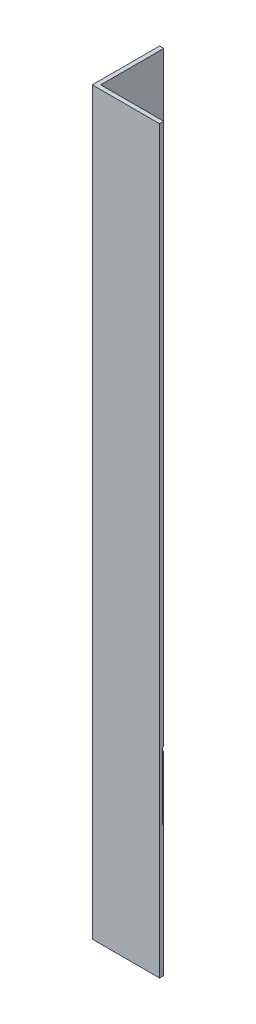
ISO-10303-21;
HEADER;
FILE_DESCRIPTION(('STEP AP214'),'2;1');
FILE_NAME('part.step','',(''),(''),'','','');
FILE_SCHEMA(('AUTOMOTIVE_DESIGN { 1 0 10303 214 1 1 1 1 }'));
ENDSEC;
DATA;
#1=APPLICATION_CONTEXT('core data for automotive mechanical design processes');
#2=APPLICATION_PROTOCOL_DEFINITION('international standard','automotive_design',2000,#1);
#3=PRODUCT_CONTEXT('',#1,'mechanical');
#4=PRODUCT('Part','Part','',(#3));
#5=PRODUCT_RELATED_PRODUCT_CATEGORY('part','',(#4));
#6=PRODUCT_DEFINITION_FORMATION('','',#4);
#7=PRODUCT_DEFINITION_CONTEXT('part definition',#1,'design');
#8=PRODUCT_DEFINITION('design','',#6,#7);
#9=PRODUCT_DEFINITION_SHAPE('','',#8);
#10=(LENGTH_UNIT() NAMED_UNIT(*) SI_UNIT(.MILLI.,.METRE.));
#11=(NAMED_UNIT(*) PLANE_ANGLE_UNIT() SI_UNIT($,.RADIAN.));
#12=(NAMED_UNIT(*) SI_UNIT($,.STERADIAN.) SOLID_ANGLE_UNIT());
#13=UNCERTAINTY_MEASURE_WITH_UNIT(LENGTH_MEASURE(1.E-05),#10,'distance_accuracy_value','');
#14=(GEOMETRIC_REPRESENTATION_CONTEXT(3) GLOBAL_UNCERTAINTY_ASSIGNED_CONTEXT((#13)) GLOBAL_UNIT_ASSIGNED_CONTEXT((#10,
#11,#12)) REPRESENTATION_CONTEXT('',''));
#15=CARTESIAN_POINT('',(0.,0.,0.));
#16=DIRECTION('',(0.,0.,1.));
#17=DIRECTION('',(1.,0.,0.));
#18=AXIS2_PLACEMENT_3D('',#15,#16,#17);
#19=CARTESIAN_POINT('',(1.5875,279.4,-1.5875));
#20=DIRECTION('',(0.,0.,1.));
#21=DIRECTION('',(1.,0.,0.));
#22=AXIS2_PLACEMENT_3D('',#19,#20,#21);
#23=PLANE('',#22);
#24=DIRECTION('',(0.,-1.,0.));
#25=VECTOR('',#24,1.);
#26=CARTESIAN_POINT('',(25.4,279.4,-1.5875));
#27=LINE('',#26,#25);
#28=CARTESIAN_POINT('',(25.4,279.4,-1.5875));
#29=VERTEX_POINT('',#28);
#30=CARTESIAN_POINT('',(25.4,75.0189,-1.5875));
#31=VERTEX_POINT('',#30);
#32=EDGE_CURVE('E43',#29,#31,#27,.T.);
#33=ORIENTED_EDGE('',*,*,#32,.T.);
#34=DIRECTION('',(-1.,0.,0.));
#35=VECTOR('',#34,1.);
#36=CARTESIAN_POINT('',(1.5875,75.0189,-1.5875));
#37=LINE('',#36,#35);
#38=CARTESIAN_POINT('',(1.5875,75.0189,-1.5875));
#39=VERTEX_POINT('',#38);
#40=EDGE_CURVE('E138',#31,#39,#37,.T.);
#41=ORIENTED_EDGE('',*,*,#40,.T.);
#42=DIRECTION('',(0.,-1.,0.));
#43=VECTOR('',#42,1.);
#44=CARTESIAN_POINT('',(1.5875,279.4,-1.5875));
#45=LINE('',#44,#43);
#46=CARTESIAN_POINT('',(1.5875,279.4,-1.5875));
#47=VERTEX_POINT('',#46);
#48=EDGE_CURVE('E155',#47,#39,#45,.T.);
#49=ORIENTED_EDGE('',*,*,#48,.F.);
#50=DIRECTION('',(-1.,0.,0.));
#51=VECTOR('',#50,1.);
#52=CARTESIAN_POINT('',(1.5875,279.4,-1.5875));
#53=LINE('',#52,#51);
#54=EDGE_CURVE('E109',#29,#47,#53,.T.);
#55=ORIENTED_EDGE('',*,*,#54,.F.);
#56=EDGE_LOOP('',(#33,#41,#49,#55));
#57=FACE_BOUND('',#56,.T.);
#58=ADVANCED_FACE('F35',(#57),#23,.F.);
#59=CARTESIAN_POINT('',(1.5875,279.4,-25.4));
#60=DIRECTION('',(-1.,0.,0.));
#61=DIRECTION('',(0.,0.,1.));
#62=AXIS2_PLACEMENT_3D('',#59,#60,#61);
#63=PLANE('',#62);
#64=ORIENTED_EDGE('',*,*,#48,.T.);
#65=DIRECTION('',(0.,0.,-1.));
#66=VECTOR('',#65,1.);
#67=CARTESIAN_POINT('',(1.5875,75.0189,-25.4));
#68=LINE('',#67,#66);
#69=CARTESIAN_POINT('',(1.5875,75.0189,-25.4));
#70=VERTEX_POINT('',#69);
#71=EDGE_CURVE('E120',#39,#70,#68,.T.);
#72=ORIENTED_EDGE('',*,*,#71,.T.);
#73=DIRECTION('',(0.,-1.,0.));
#74=VECTOR('',#73,1.);
#75=CARTESIAN_POINT('',(1.5875,279.4,-25.4));
#76=LINE('',#75,#74);
#77=CARTESIAN_POINT('',(1.5875,279.4,-25.4));
#78=VERTEX_POINT('',#77);
#79=EDGE_CURVE('E116',#78,#70,#76,.T.);
#80=ORIENTED_EDGE('',*,*,#79,.F.);
#81=DIRECTION('',(0.,0.,-1.));
#82=VECTOR('',#81,1.);
#83=CARTESIAN_POINT('',(1.5875,279.4,-25.4));
#84=LINE('',#83,#82);
#85=EDGE_CURVE('E102',#47,#78,#84,.T.);
#86=ORIENTED_EDGE('',*,*,#85,.F.);
#87=EDGE_LOOP('',(#64,#72,#80,#86));
#88=FACE_BOUND('',#87,.T.);
#89=ADVANCED_FACE('F117',(#88),#63,.F.);
#90=CARTESIAN_POINT('',(0.,279.4,-25.4));
#91=DIRECTION('',(0.,0.,1.));
#92=DIRECTION('',(1.,0.,0.));
#93=AXIS2_PLACEMENT_3D('',#90,#91,#92);
#94=PLANE('',#93);
#95=ORIENTED_EDGE('',*,*,#79,.T.);
#96=DIRECTION('',(-1.,0.,0.));
#97=VECTOR('',#96,1.);
#98=CARTESIAN_POINT('',(25.4,75.0189,-25.4));
#99=LINE('',#98,#97);
#100=CARTESIAN_POINT('',(0.,75.0189,-25.4));
#101=VERTEX_POINT('',#100);
#102=EDGE_CURVE('E195',#70,#101,#99,.T.);
#103=ORIENTED_EDGE('',*,*,#102,.T.);
#104=DIRECTION('',(0.,-1.,0.));
#105=VECTOR('',#104,1.);
#106=CARTESIAN_POINT('',(0.,279.4,-25.4));
#107=LINE('',#106,#105);
#108=CARTESIAN_POINT('',(0.,279.4,-25.4));
#109=VERTEX_POINT('',#108);
#110=EDGE_CURVE('E128',#109,#101,#107,.T.);
#111=ORIENTED_EDGE('',*,*,#110,.F.);
#112=DIRECTION('',(-1.,0.,0.));
#113=VECTOR('',#112,1.);
#114=CARTESIAN_POINT('',(0.,279.4,-25.4));
#115=LINE('',#114,#113);
#116=EDGE_CURVE('E106',#78,#109,#115,.T.);
#117=ORIENTED_EDGE('',*,*,#116,.F.);
#118=EDGE_LOOP('',(#95,#103,#111,#117));
#119=FACE_BOUND('',#118,.T.);
#120=ADVANCED_FACE('F126',(#119),#94,.F.);
#121=CARTESIAN_POINT('',(25.4,279.4,0.));
#122=DIRECTION('',(0.,0.,-1.));
#123=DIRECTION('',(-1.,0.,0.));
#124=AXIS2_PLACEMENT_3D('',#121,#122,#123);
#125=PLANE('',#124);
#126=DIRECTION('',(1.,0.,0.));
#127=VECTOR('',#126,1.);
#128=CARTESIAN_POINT('',(25.4,0.,0.));
#129=LINE('',#128,#127);
#130=CARTESIAN_POINT('',(0.,0.,0.));
#131=VERTEX_POINT('',#130);
#132=CARTESIAN_POINT('',(25.4,0.,0.));
#133=VERTEX_POINT('',#132);
#134=EDGE_CURVE('E134',#131,#133,#129,.T.);
#135=ORIENTED_EDGE('',*,*,#134,.T.);
#136=DIRECTION('',(0.,-1.,0.));
#137=VECTOR('',#136,1.);
#138=CARTESIAN_POINT('',(25.4,279.4,0.));
#139=LINE('',#138,#137);
#140=CARTESIAN_POINT('',(25.4,279.4,0.));
#141=VERTEX_POINT('',#140);
#142=EDGE_CURVE('E11',#141,#133,#139,.T.);
#143=ORIENTED_EDGE('',*,*,#142,.F.);
#144=DIRECTION('',(1.,0.,0.));
#145=VECTOR('',#144,1.);
#146=CARTESIAN_POINT('',(25.4,279.4,0.));
#147=LINE('',#146,#145);
#148=CARTESIAN_POINT('',(0.,279.4,0.));
#149=VERTEX_POINT('',#148);
#150=EDGE_CURVE('E151',#149,#141,#147,.T.);
#151=ORIENTED_EDGE('',*,*,#150,.F.);
#152=DIRECTION('',(0.,-1.,0.));
#153=VECTOR('',#152,1.);
#154=CARTESIAN_POINT('',(0.,279.4,0.));
#155=LINE('',#154,#153);
#156=EDGE_CURVE('E130',#149,#131,#155,.T.);
#157=ORIENTED_EDGE('',*,*,#156,.T.);
#158=EDGE_LOOP('',(#135,#143,#151,#157));
#159=FACE_BOUND('',#158,.T.);
#160=ADVANCED_FACE('F37',(#159),#125,.F.);
#161=CARTESIAN_POINT('',(25.4,279.4,-1.5875));
#162=DIRECTION('',(-1.,0.,0.));
#163=DIRECTION('',(0.,0.,1.));
#164=AXIS2_PLACEMENT_3D('',#161,#162,#163);
#165=PLANE('',#164);
#166=DIRECTION('',(0.,1.,0.));
#167=VECTOR('',#166,1.);
#168=CARTESIAN_POINT('',(25.4,49.6189,-1.084072));
#169=LINE('',#168,#167);
#170=CARTESIAN_POINT('',(25.4,49.6189,-1.084072));
#171=VERTEX_POINT('',#170);
#172=CARTESIAN_POINT('',(25.4,75.0189,-1.084072));
#173=VERTEX_POINT('',#172);
#174=EDGE_CURVE('E208',#171,#173,#169,.T.);
#175=ORIENTED_EDGE('',*,*,#174,.T.);
#176=DIRECTION('',(0.,0.,-1.));
#177=VECTOR('',#176,1.);
#178=CARTESIAN_POINT('',(25.4,75.0189,-25.4));
#179=LINE('',#178,#177);
#180=EDGE_CURVE('E205',#173,#31,#179,.T.);
#181=ORIENTED_EDGE('',*,*,#180,.T.);
#182=ORIENTED_EDGE('',*,*,#32,.F.);
#183=DIRECTION('',(0.,0.,-1.));
#184=VECTOR('',#183,1.);
#185=CARTESIAN_POINT('',(25.4,279.4,-1.5875));
#186=LINE('',#185,#184);
#187=EDGE_CURVE('E93',#141,#29,#186,.T.);
#188=ORIENTED_EDGE('',*,*,#187,.F.);
#189=ORIENTED_EDGE('',*,*,#142,.T.);
#190=DIRECTION('',(0.,0.,-1.));
#191=VECTOR('',#190,1.);
#192=CARTESIAN_POINT('',(25.4,0.,-1.5875));
#193=LINE('',#192,#191);
#194=CARTESIAN_POINT('',(25.4,0.,-1.5875));
#195=VERTEX_POINT('',#194);
#196=EDGE_CURVE('E137',#133,#195,#193,.T.);
#197=ORIENTED_EDGE('',*,*,#196,.T.);
#198=CARTESIAN_POINT('',(25.4,49.6189,-1.5875));
#199=VERTEX_POINT('',#198);
#200=EDGE_CURVE('E156',#199,#195,#27,.T.);
#201=ORIENTED_EDGE('',*,*,#200,.F.);
#202=DIRECTION('',(0.,0.,1.));
#203=VECTOR('',#202,1.);
#204=CARTESIAN_POINT('',(25.4,49.6189,-25.4));
#205=LINE('',#204,#203);
#206=EDGE_CURVE('E213',#199,#171,#205,.T.);
#207=ORIENTED_EDGE('',*,*,#206,.T.);
#208=EDGE_LOOP('',(#175,#181,#182,#188,#189,#197,#201,#207));
#209=FACE_BOUND('',#208,.T.);
#210=ADVANCED_FACE('F173',(#209),#165,.F.);
#211=CARTESIAN_POINT('',(1.5875,49.6189,-1.5875));
#212=VERTEX_POINT('',#211);
#213=CARTESIAN_POINT('',(1.5875,0.,-1.5875));
#214=VERTEX_POINT('',#213);
#215=EDGE_CURVE('E123',#212,#214,#45,.T.);
#216=ORIENTED_EDGE('',*,*,#215,.F.);
#217=DIRECTION('',(1.,0.,0.));
#218=VECTOR('',#217,1.);
#219=CARTESIAN_POINT('',(1.5875,49.6189,-1.5875));
#220=LINE('',#219,#218);
#221=EDGE_CURVE('E170',#212,#199,#220,.T.);
#222=ORIENTED_EDGE('',*,*,#221,.T.);
#223=ORIENTED_EDGE('',*,*,#200,.T.);
#224=DIRECTION('',(-1.,0.,0.));
#225=VECTOR('',#224,1.);
#226=CARTESIAN_POINT('',(1.5875,0.,-1.5875));
#227=LINE('',#226,#225);
#228=EDGE_CURVE('E141',#195,#214,#227,.T.);
#229=ORIENTED_EDGE('',*,*,#228,.T.);
#230=EDGE_LOOP('',(#216,#222,#223,#229));
#231=FACE_BOUND('',#230,.T.);
#232=ADVANCED_FACE('F165',(#231),#23,.F.);
#233=CARTESIAN_POINT('',(1.5875,49.6189,-25.4));
#234=VERTEX_POINT('',#233);
#235=CARTESIAN_POINT('',(1.5875,0.,-25.4));
#236=VERTEX_POINT('',#235);
#237=EDGE_CURVE('E124',#234,#236,#76,.T.);
#238=ORIENTED_EDGE('',*,*,#237,.F.);
#239=DIRECTION('',(0.,0.,1.));
#240=VECTOR('',#239,1.);
#241=CARTESIAN_POINT('',(1.5875,49.6189,-25.3999999999999));
#242=LINE('',#241,#240);
#243=EDGE_CURVE('E185',#234,#212,#242,.T.);
#244=ORIENTED_EDGE('',*,*,#243,.T.);
#245=ORIENTED_EDGE('',*,*,#215,.T.);
#246=DIRECTION('',(0.,0.,-1.));
#247=VECTOR('',#246,1.);
#248=CARTESIAN_POINT('',(1.5875,0.,-25.4));
#249=LINE('',#248,#247);
#250=EDGE_CURVE('E144',#214,#236,#249,.T.);
#251=ORIENTED_EDGE('',*,*,#250,.T.);
#252=EDGE_LOOP('',(#238,#244,#245,#251));
#253=FACE_BOUND('',#252,.T.);
#254=ADVANCED_FACE('F181',(#253),#63,.F.);
#255=CARTESIAN_POINT('',(0.,49.6189,-25.4));
#256=VERTEX_POINT('',#255);
#257=CARTESIAN_POINT('',(0.,0.,-25.4));
#258=VERTEX_POINT('',#257);
#259=EDGE_CURVE('E153',#256,#258,#107,.T.);
#260=ORIENTED_EDGE('',*,*,#259,.F.);
#261=DIRECTION('',(-1.,0.,0.));
#262=VECTOR('',#261,1.);
#263=CARTESIAN_POINT('',(25.4,49.6189,-25.4));
#264=LINE('',#263,#262);
#265=EDGE_CURVE('E50',#234,#256,#264,.T.);
#266=ORIENTED_EDGE('',*,*,#265,.F.);
#267=ORIENTED_EDGE('',*,*,#237,.T.);
#268=DIRECTION('',(-1.,0.,0.));
#269=VECTOR('',#268,1.);
#270=CARTESIAN_POINT('',(0.,0.,-25.4));
#271=LINE('',#270,#269);
#272=EDGE_CURVE('E147',#236,#258,#271,.T.);
#273=ORIENTED_EDGE('',*,*,#272,.T.);
#274=EDGE_LOOP('',(#260,#266,#267,#273));
#275=FACE_BOUND('',#274,.T.);
#276=ADVANCED_FACE('F248',(#275),#94,.F.);
#277=CARTESIAN_POINT('',(0.,279.4,0.));
#278=DIRECTION('',(1.,0.,0.));
#279=DIRECTION('',(0.,0.,-1.));
#280=AXIS2_PLACEMENT_3D('',#277,#278,#279);
#281=PLANE('',#280);
#282=ORIENTED_EDGE('',*,*,#110,.T.);
#283=DIRECTION('',(0.,0.,-1.));
#284=VECTOR('',#283,1.);
#285=CARTESIAN_POINT('',(0.,75.0189,-25.4));
#286=LINE('',#285,#284);
#287=CARTESIAN_POINT('',(0.,75.0189,-1.084072));
#288=VERTEX_POINT('',#287);
#289=EDGE_CURVE('E222',#288,#101,#286,.T.);
#290=ORIENTED_EDGE('',*,*,#289,.F.);
#291=DIRECTION('',(0.,1.,0.));
#292=VECTOR('',#291,1.);
#293=CARTESIAN_POINT('',(0.,49.6189,-1.084072));
#294=LINE('',#293,#292);
#295=CARTESIAN_POINT('',(0.,49.6189,-1.084072));
#296=VERTEX_POINT('',#295);
#297=EDGE_CURVE('E219',#296,#288,#294,.T.);
#298=ORIENTED_EDGE('',*,*,#297,.F.);
#299=DIRECTION('',(0.,0.,1.));
#300=VECTOR('',#299,1.);
#301=CARTESIAN_POINT('',(0.,49.6189,-25.4));
#302=LINE('',#301,#300);
#303=EDGE_CURVE('E217',#256,#296,#302,.T.);
#304=ORIENTED_EDGE('',*,*,#303,.F.);
#305=ORIENTED_EDGE('',*,*,#259,.T.);
#306=DIRECTION('',(0.,0.,1.));
#307=VECTOR('',#306,1.);
#308=CARTESIAN_POINT('',(0.,0.,0.));
#309=LINE('',#308,#307);
#310=EDGE_CURVE('E85',#258,#131,#309,.T.);
#311=ORIENTED_EDGE('',*,*,#310,.T.);
#312=ORIENTED_EDGE('',*,*,#156,.F.);
#313=DIRECTION('',(0.,0.,1.));
#314=VECTOR('',#313,1.);
#315=CARTESIAN_POINT('',(0.,279.4,0.));
#316=LINE('',#315,#314);
#317=EDGE_CURVE('E59',#109,#149,#316,.T.);
#318=ORIENTED_EDGE('',*,*,#317,.F.);
#319=EDGE_LOOP('',(#282,#290,#298,#304,#305,#311,#312,#318));
#320=FACE_BOUND('',#319,.T.);
#321=ADVANCED_FACE('F241',(#320),#281,.F.);
#322=CARTESIAN_POINT('',(0.,279.4,0.));
#323=DIRECTION('',(0.,-1.,0.));
#324=DIRECTION('',(0.,0.,-1.));
#325=AXIS2_PLACEMENT_3D('',#322,#323,#324);
#326=PLANE('',#325);
#327=ORIENTED_EDGE('',*,*,#150,.T.);
#328=ORIENTED_EDGE('',*,*,#187,.T.);
#329=ORIENTED_EDGE('',*,*,#54,.T.);
#330=ORIENTED_EDGE('',*,*,#85,.T.);
#331=ORIENTED_EDGE('',*,*,#116,.T.);
#332=ORIENTED_EDGE('',*,*,#317,.T.);
#333=EDGE_LOOP('',(#327,#328,#329,#330,#331,#332));
#334=FACE_BOUND('',#333,.T.);
#335=ADVANCED_FACE('F104',(#334),#326,.F.);
#336=CARTESIAN_POINT('',(0.,0.,0.));
#337=DIRECTION('',(0.,-1.,0.));
#338=DIRECTION('',(0.,0.,-1.));
#339=AXIS2_PLACEMENT_3D('',#336,#337,#338);
#340=PLANE('',#339);
#341=ORIENTED_EDGE('',*,*,#134,.F.);
#342=ORIENTED_EDGE('',*,*,#310,.F.);
#343=ORIENTED_EDGE('',*,*,#272,.F.);
#344=ORIENTED_EDGE('',*,*,#250,.F.);
#345=ORIENTED_EDGE('',*,*,#228,.F.);
#346=ORIENTED_EDGE('',*,*,#196,.F.);
#347=EDGE_LOOP('',(#341,#342,#343,#344,#345,#346));
#348=FACE_BOUND('',#347,.T.);
#349=ADVANCED_FACE('F177',(#348),#340,.T.);
#350=CARTESIAN_POINT('',(25.4,75.0189,-25.4));
#351=DIRECTION('',(0.,1.,0.));
#352=DIRECTION('',(0.,0.,1.));
#353=AXIS2_PLACEMENT_3D('',#350,#351,#352);
#354=PLANE('',#353);
#355=ORIENTED_EDGE('',*,*,#180,.F.);
#356=DIRECTION('',(-1.,0.,0.));
#357=VECTOR('',#356,1.);
#358=CARTESIAN_POINT('',(25.4,75.0189,-1.084072));
#359=LINE('',#358,#357);
#360=EDGE_CURVE('E225',#173,#288,#359,.T.);
#361=ORIENTED_EDGE('',*,*,#360,.T.);
#362=ORIENTED_EDGE('',*,*,#289,.T.);
#363=ORIENTED_EDGE('',*,*,#102,.F.);
#364=ORIENTED_EDGE('',*,*,#71,.F.);
#365=ORIENTED_EDGE('',*,*,#40,.F.);
#366=EDGE_LOOP('',(#355,#361,#362,#363,#364,#365));
#367=FACE_BOUND('',#366,.T.);
#368=ADVANCED_FACE('F197',(#367),#354,.F.);
#369=CARTESIAN_POINT('',(25.4,49.6189,-25.4));
#370=DIRECTION('',(0.,-1.,0.));
#371=DIRECTION('',(0.,0.,-1.));
#372=AXIS2_PLACEMENT_3D('',#369,#370,#371);
#373=PLANE('',#372);
#374=ORIENTED_EDGE('',*,*,#243,.F.);
#375=ORIENTED_EDGE('',*,*,#265,.T.);
#376=ORIENTED_EDGE('',*,*,#303,.T.);
#377=DIRECTION('',(-1.,0.,0.));
#378=VECTOR('',#377,1.);
#379=CARTESIAN_POINT('',(25.4,49.6189,-1.084072));
#380=LINE('',#379,#378);
#381=EDGE_CURVE('E211',#171,#296,#380,.T.);
#382=ORIENTED_EDGE('',*,*,#381,.F.);
#383=ORIENTED_EDGE('',*,*,#206,.F.);
#384=ORIENTED_EDGE('',*,*,#221,.F.);
#385=EDGE_LOOP('',(#374,#375,#376,#382,#383,#384));
#386=FACE_BOUND('',#385,.T.);
#387=ADVANCED_FACE('F239',(#386),#373,.F.);
#388=CARTESIAN_POINT('',(25.4,49.6189,-1.084072));
#389=DIRECTION('',(0.,0.,1.));
#390=DIRECTION('',(0.,-1.,0.));
#391=AXIS2_PLACEMENT_3D('',#388,#389,#390);
#392=PLANE('',#391);
#393=ORIENTED_EDGE('',*,*,#297,.T.);
#394=ORIENTED_EDGE('',*,*,#360,.F.);
#395=ORIENTED_EDGE('',*,*,#174,.F.);
#396=ORIENTED_EDGE('',*,*,#381,.T.);
#397=EDGE_LOOP('',(#393,#394,#395,#396));
#398=FACE_BOUND('',#397,.T.);
#399=ADVANCED_FACE('F232',(#398),#392,.F.);
#400=CLOSED_SHELL('',(#58,#89,#120,#160,#210,#232,#254,#276,#321,#335,#349,#368,#387,#399));
#401=MANIFOLD_SOLID_BREP('B2',#400);
#402=ADVANCED_BREP_SHAPE_REPRESENTATION('',(#18,#401),#14);
#403=SHAPE_DEFINITION_REPRESENTATION(#9,#402);
ENDSEC;
END-ISO-10303-21;
